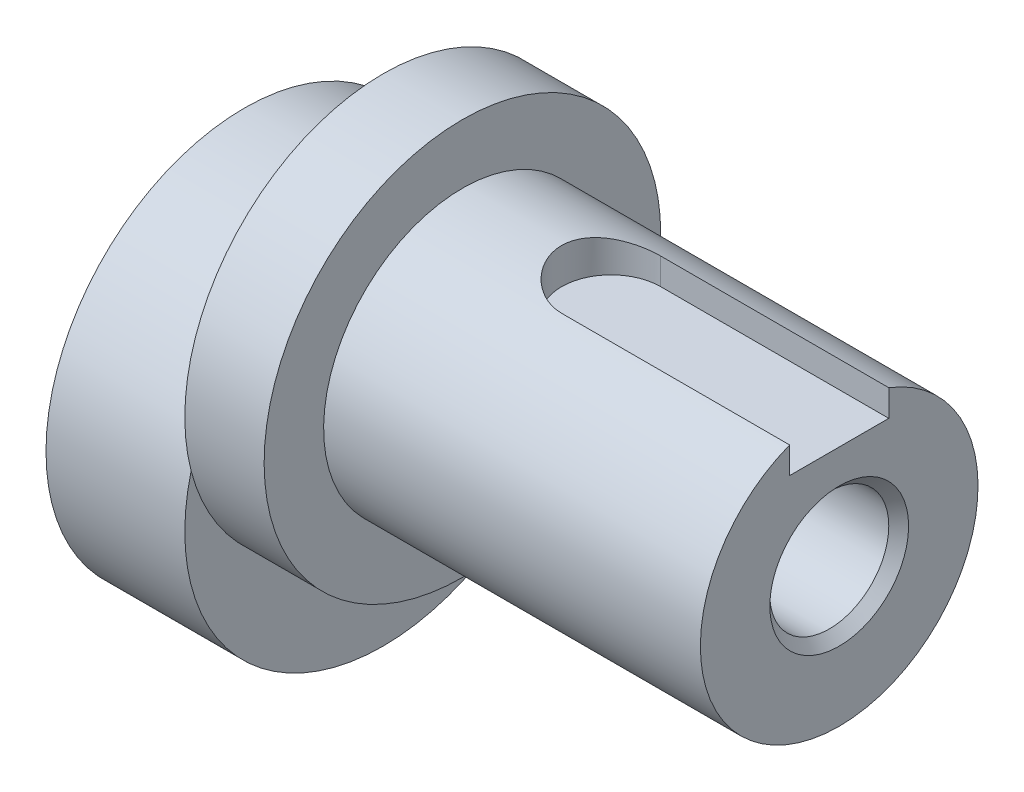
ISO-10303-21;
HEADER;
FILE_DESCRIPTION(('STEP AP214'),'2;1');
FILE_NAME('part.step','',(''),(''),'','','');
FILE_SCHEMA(('AUTOMOTIVE_DESIGN { 1 0 10303 214 1 1 1 1 }'));
ENDSEC;
DATA;
#1=APPLICATION_CONTEXT('core data for automotive mechanical design processes');
#2=APPLICATION_PROTOCOL_DEFINITION('international standard','automotive_design',2000,#1);
#3=PRODUCT_CONTEXT('',#1,'mechanical');
#4=PRODUCT('Part','Part','',(#3));
#5=PRODUCT_RELATED_PRODUCT_CATEGORY('part','',(#4));
#6=PRODUCT_DEFINITION_FORMATION('','',#4);
#7=PRODUCT_DEFINITION_CONTEXT('part definition',#1,'design');
#8=PRODUCT_DEFINITION('design','',#6,#7);
#9=PRODUCT_DEFINITION_SHAPE('','',#8);
#10=(LENGTH_UNIT() NAMED_UNIT(*) SI_UNIT(.MILLI.,.METRE.));
#11=(NAMED_UNIT(*) PLANE_ANGLE_UNIT() SI_UNIT($,.RADIAN.));
#12=(NAMED_UNIT(*) SI_UNIT($,.STERADIAN.) SOLID_ANGLE_UNIT());
#13=UNCERTAINTY_MEASURE_WITH_UNIT(LENGTH_MEASURE(1.E-05),#10,'distance_accuracy_value','');
#14=(GEOMETRIC_REPRESENTATION_CONTEXT(3) GLOBAL_UNCERTAINTY_ASSIGNED_CONTEXT((#13)) GLOBAL_UNIT_ASSIGNED_CONTEXT((#10,
#11,#12)) REPRESENTATION_CONTEXT('',''));
#15=CARTESIAN_POINT('',(0.,0.,0.));
#16=DIRECTION('',(0.,0.,1.));
#17=DIRECTION('',(1.,0.,0.));
#18=AXIS2_PLACEMENT_3D('',#15,#16,#17);
#19=CARTESIAN_POINT('',(30.,5.,0.));
#20=DIRECTION('',(-1.,0.,0.));
#21=DIRECTION('',(0.,0.,1.));
#22=AXIS2_PLACEMENT_3D('',#19,#20,#21);
#23=CYLINDRICAL_SURFACE('',#22,7.);
#24=CARTESIAN_POINT('',(11.,5.,0.));
#25=DIRECTION('',(1.,0.,0.));
#26=DIRECTION('',(0.,0.,-1.));
#27=AXIS2_PLACEMENT_3D('',#24,#25,#26);
#28=CIRCLE('',#27,7.);
#29=CARTESIAN_POINT('',(11.,5.,-7.));
#30=VERTEX_POINT('',#29);
#31=EDGE_CURVE('E118',#30,#30,#28,.T.);
#32=ORIENTED_EDGE('',*,*,#31,.T.);
#33=EDGE_LOOP('',(#32));
#34=FACE_BOUND('',#33,.T.);
#35=DIRECTION('',(-1.,0.,0.));
#36=VECTOR('',#35,1.);
#37=CARTESIAN_POINT('',(30.,11.538348415311,-2.5));
#38=LINE('',#37,#36);
#39=CARTESIAN_POINT('',(30.,11.538348415311,-2.5));
#40=VERTEX_POINT('',#39);
#41=CARTESIAN_POINT('',(18.5,11.538348415311,-2.5));
#42=VERTEX_POINT('',#41);
#43=EDGE_CURVE('E94',#40,#42,#38,.T.);
#44=ORIENTED_EDGE('',*,*,#43,.F.);
#45=CARTESIAN_POINT('',(30.,5.,0.));
#46=DIRECTION('',(1.,0.,0.));
#47=DIRECTION('',(0.,0.,-1.));
#48=AXIS2_PLACEMENT_3D('',#45,#46,#47);
#49=CIRCLE('',#48,7.);
#50=CARTESIAN_POINT('',(30.,11.538348415311,2.5));
#51=VERTEX_POINT('',#50);
#52=EDGE_CURVE('E114',#51,#40,#49,.T.);
#53=ORIENTED_EDGE('',*,*,#52,.F.);
#54=DIRECTION('',(-1.,0.,0.));
#55=VECTOR('',#54,1.);
#56=CARTESIAN_POINT('',(30.,11.538348415311,2.5));
#57=LINE('',#56,#55);
#58=CARTESIAN_POINT('',(18.5,11.538348415311,2.5));
#59=VERTEX_POINT('',#58);
#60=EDGE_CURVE('E98',#59,#51,#57,.F.);
#61=ORIENTED_EDGE('',*,*,#60,.F.);
#62=CARTESIAN_POINT('',(18.5,11.538348415311,-2.5));
#63=CARTESIAN_POINT('',(18.4321107542711,11.5383365378513,-2.50000932220903));
#64=CARTESIAN_POINT('',(18.3642280673609,11.5394054992274,-2.49723485076694));
#65=CARTESIAN_POINT('',(18.2289960893886,11.5436165747813,-2.4861910211816));
#66=CARTESIAN_POINT('',(18.1616466413939,11.5467580541806,-2.47792334551208));
#67=CARTESIAN_POINT('',(18.0281785853972,11.5550121763794,-2.456001752859));
#68=CARTESIAN_POINT('',(17.9620566636602,11.5601183170568,-2.44236559963955));
#69=CARTESIAN_POINT('',(17.8312981648915,11.5721317785417,-2.40985115466648));
#70=CARTESIAN_POINT('',(17.7666616536876,11.5790391790075,-2.39097263107435));
#71=CARTESIAN_POINT('',(17.5757356335225,11.6021493436571,-2.32673964179204));
#72=CARTESIAN_POINT('',(17.4522095478644,11.6207547534084,-2.27375112606986));
#73=CARTESIAN_POINT('',(17.215769666872,11.6622539736071,-2.14910757865425));
#74=CARTESIAN_POINT('',(17.1028636832645,11.6851509042488,-2.07743895048849));
#75=CARTESIAN_POINT('',(16.8857847866473,11.7337991379222,-1.9140257110197));
#76=CARTESIAN_POINT('',(16.7821535248041,11.7596286404137,-1.82158337146744));
#77=CARTESIAN_POINT('',(16.5914912952836,11.8105759232303,-1.6207338877633));
#78=CARTESIAN_POINT('',(16.5044634207566,11.8356935701987,-1.51232377552673));
#79=CARTESIAN_POINT('',(16.346910144545,11.8833113327905,-1.27853915335934));
#80=CARTESIAN_POINT('',(16.2769684781395,11.905708352238,-1.15274833789185));
#81=CARTESIAN_POINT('',(16.1594633532026,11.9444235767263,-0.890250825476634));
#82=CARTESIAN_POINT('',(16.111892220954,11.9607438658547,-0.753547890540326));
#83=CARTESIAN_POINT('',(16.0423593978176,11.9849105051071,-0.478829979256174));
#84=CARTESIAN_POINT('',(16.0194608695289,11.9930659435251,-0.341079835227466));
#85=CARTESIAN_POINT('',(15.9969315972223,12.0010879805382,-0.0634643052969036));
#86=CARTESIAN_POINT('',(15.9972944139653,12.000956873027,0.0764004845074482));
#87=CARTESIAN_POINT('',(16.0207112737611,11.9926225804908,0.347593258486945));
#88=CARTESIAN_POINT('',(16.0427447941985,11.9847824358352,0.47902240707872));
#89=CARTESIAN_POINT('',(16.1071734241588,11.9623783250735,0.736175812143607));
#90=CARTESIAN_POINT('',(16.1495696843625,11.9478139789904,0.861899745780464));
#91=CARTESIAN_POINT('',(16.2540469115653,11.9131650689037,1.10616102429807));
#92=CARTESIAN_POINT('',(16.3163957149601,11.8930059216431,1.22457279066906));
#93=CARTESIAN_POINT('',(16.4587793352234,11.8492335561632,1.44953531305523));
#94=CARTESIAN_POINT('',(16.5388195237836,11.8256192895926,1.5560824517677));
#95=CARTESIAN_POINT('',(16.7193232636567,11.7759054780549,1.7603244525607));
#96=CARTESIAN_POINT('',(16.8206497231449,11.7497405584388,1.85724185700417));
#97=CARTESIAN_POINT('',(17.0383273641656,11.6989034246898,2.03299914621296));
#98=CARTESIAN_POINT('',(17.1546839051685,11.6742317476526,2.11183255456462));
#99=CARTESIAN_POINT('',(17.401942598522,11.628778038754,2.25049860898459));
#100=CARTESIAN_POINT('',(17.5330789755054,11.6080787511899,2.30994207989625));
#101=CARTESIAN_POINT('',(17.8043648015822,11.5738821361027,2.4055543972585));
#102=CARTESIAN_POINT('',(17.944499141169,11.5603730716505,2.44176119399954));
#103=CARTESIAN_POINT('',(18.1550305442642,11.5470854224556,2.47705497148627));
#104=CARTESIAN_POINT('',(18.2237363017718,11.5438201096791,2.48565347586445));
#105=CARTESIAN_POINT('',(18.3616151641917,11.5394491082968,2.49712352174882));
#106=CARTESIAN_POINT('',(18.4307876671005,11.5383410314093,2.50000139665367));
#107=CARTESIAN_POINT('',(18.5,11.538348415311,2.5));
#108=B_SPLINE_CURVE_WITH_KNOTS('',3,(#62,#63,#64,#65,#66,#67,#68,#69,#70,#71,#72,#73,#74,#75,
#76,#77,#78,#79,#80,#81,#82,#83,#84,#85,#86,#87,#88,#89,#90,#91,#92,#93,#94,#95,#96,#97,#98,#99,
#100,#101,#102,#103,#104,#105,#106,#107),.UNSPECIFIED.,.F.,.F.,(4,2,2,2,2,2,2,2,2,2,2,2,2,2,2,2,
2,2,2,2,2,2,4),(0.,0.203591628551589,0.407120929225528,0.609982356545741,0.812852756635989,
1.21793118555512,1.6233052814847,2.0451597231193,2.4670926781184,2.90188398965561,
3.33652604665238,3.75400993940861,4.17137826416922,4.56998920861347,4.96862268086888,
5.37284909448639,5.77719841367921,6.20315837945087,6.6292706567472,7.06347329058504,
7.49696496492444,7.70468580162772,7.91217653896403),.UNSPECIFIED.);
#109=EDGE_CURVE('E11',#42,#59,#108,.T.);
#110=ORIENTED_EDGE('',*,*,#109,.F.);
#111=EDGE_LOOP('',(#44,#53,#61,#110));
#112=FACE_BOUND('',#111,.T.);
#113=ADVANCED_FACE('F34',(#34,#112),#23,.T.);
#114=CARTESIAN_POINT('',(30.,5.,0.));
#115=DIRECTION('',(1.,0.,0.));
#116=DIRECTION('',(0.,0.,-1.));
#117=AXIS2_PLACEMENT_3D('',#114,#115,#116);
#118=PLANE('',#117);
#119=CARTESIAN_POINT('',(30.,5.,0.));
#120=DIRECTION('',(1.,0.,0.));
#121=DIRECTION('',(0.,0.,-1.));
#122=AXIS2_PLACEMENT_3D('',#119,#120,#121);
#123=CIRCLE('',#122,3.50000000000002);
#124=CARTESIAN_POINT('',(30.,5.,-3.50000000000002));
#125=VERTEX_POINT('',#124);
#126=EDGE_CURVE('E138',#125,#125,#123,.F.);
#127=ORIENTED_EDGE('',*,*,#126,.T.);
#128=EDGE_LOOP('',(#127));
#129=FACE_BOUND('',#128,.T.);
#130=ORIENTED_EDGE('',*,*,#52,.T.);
#131=DIRECTION('',(0.,-1.,0.));
#132=VECTOR('',#131,1.);
#133=CARTESIAN_POINT('',(30.,5.,-2.5));
#134=LINE('',#133,#132);
#135=CARTESIAN_POINT('',(30.,10.2,-2.5));
#136=VERTEX_POINT('',#135);
#137=EDGE_CURVE('E48',#40,#136,#134,.T.);
#138=ORIENTED_EDGE('',*,*,#137,.T.);
#139=DIRECTION('',(0.,0.,1.));
#140=VECTOR('',#139,1.);
#141=CARTESIAN_POINT('',(30.,10.2,0.));
#142=LINE('',#141,#140);
#143=CARTESIAN_POINT('',(30.,10.2,2.5));
#144=VERTEX_POINT('',#143);
#145=EDGE_CURVE('E104',#136,#144,#142,.T.);
#146=ORIENTED_EDGE('',*,*,#145,.T.);
#147=DIRECTION('',(0.,1.,0.));
#148=VECTOR('',#147,1.);
#149=CARTESIAN_POINT('',(30.,5.,2.5));
#150=LINE('',#149,#148);
#151=EDGE_CURVE('E145',#144,#51,#150,.T.);
#152=ORIENTED_EDGE('',*,*,#151,.T.);
#153=EDGE_LOOP('',(#130,#138,#146,#152));
#154=FACE_BOUND('',#153,.T.);
#155=ADVANCED_FACE('F148',(#129,#154),#118,.T.);
#156=CARTESIAN_POINT('',(7.,0.,0.));
#157=DIRECTION('',(-1.,0.,0.));
#158=DIRECTION('',(0.,0.,1.));
#159=AXIS2_PLACEMENT_3D('',#156,#157,#158);
#160=CYLINDRICAL_SURFACE('',#159,10.);
#161=CARTESIAN_POINT('',(7.,0.,0.));
#162=DIRECTION('',(1.,0.,0.));
#163=DIRECTION('',(0.,0.,-1.));
#164=AXIS2_PLACEMENT_3D('',#161,#162,#163);
#165=CIRCLE('',#164,10.);
#166=CARTESIAN_POINT('',(7.,2.49999999999999,-9.68245836551854));
#167=VERTEX_POINT('',#166);
#168=CARTESIAN_POINT('',(7.,2.49999999999999,9.68245836551854));
#169=VERTEX_POINT('',#168);
#170=EDGE_CURVE('E122',#167,#169,#165,.T.);
#171=ORIENTED_EDGE('',*,*,#170,.F.);
#172=EDGE_CURVE('E130',#169,#167,#165,.T.);
#173=ORIENTED_EDGE('',*,*,#172,.F.);
#174=EDGE_LOOP('',(#171,#173));
#175=FACE_BOUND('',#174,.T.);
#176=CARTESIAN_POINT('',(0.,0.,0.));
#177=DIRECTION('',(1.,0.,0.));
#178=DIRECTION('',(0.,0.,-1.));
#179=AXIS2_PLACEMENT_3D('',#176,#177,#178);
#180=CIRCLE('',#179,10.);
#181=CARTESIAN_POINT('',(0.,0.,-10.));
#182=VERTEX_POINT('',#181);
#183=EDGE_CURVE('E126',#182,#182,#180,.T.);
#184=ORIENTED_EDGE('',*,*,#183,.T.);
#185=EDGE_LOOP('',(#184));
#186=FACE_BOUND('',#185,.T.);
#187=ADVANCED_FACE('F167',(#175,#186),#160,.T.);
#188=CARTESIAN_POINT('',(7.,0.,0.));
#189=DIRECTION('',(1.,0.,0.));
#190=DIRECTION('',(0.,0.,-1.));
#191=AXIS2_PLACEMENT_3D('',#188,#189,#190);
#192=PLANE('',#191);
#193=CARTESIAN_POINT('',(7.,5.,0.));
#194=DIRECTION('',(1.,0.,0.));
#195=DIRECTION('',(0.,0.,-1.));
#196=AXIS2_PLACEMENT_3D('',#193,#194,#195);
#197=CIRCLE('',#196,10.);
#198=EDGE_CURVE('E62',#169,#167,#197,.T.);
#199=ORIENTED_EDGE('',*,*,#198,.F.);
#200=ORIENTED_EDGE('',*,*,#172,.T.);
#201=EDGE_LOOP('',(#199,#200));
#202=FACE_BOUND('',#201,.T.);
#203=ADVANCED_FACE('F187',(#202),#192,.T.);
#204=CARTESIAN_POINT('',(0.,0.,0.));
#205=DIRECTION('',(1.,0.,0.));
#206=DIRECTION('',(0.,0.,-1.));
#207=AXIS2_PLACEMENT_3D('',#204,#205,#206);
#208=PLANE('',#207);
#209=CARTESIAN_POINT('',(0.,5.,0.));
#210=DIRECTION('',(1.,0.,0.));
#211=DIRECTION('',(0.,0.,-1.));
#212=AXIS2_PLACEMENT_3D('',#209,#210,#211);
#213=CIRCLE('',#212,3.5);
#214=CARTESIAN_POINT('',(0.,5.,-3.5));
#215=VERTEX_POINT('',#214);
#216=EDGE_CURVE('E141',#215,#215,#213,.T.);
#217=ORIENTED_EDGE('',*,*,#216,.T.);
#218=EDGE_LOOP('',(#217));
#219=FACE_BOUND('',#218,.T.);
#220=ORIENTED_EDGE('',*,*,#183,.F.);
#221=EDGE_LOOP('',(#220));
#222=FACE_BOUND('',#221,.T.);
#223=ADVANCED_FACE('F182',(#219,#222),#208,.F.);
#224=CARTESIAN_POINT('',(7.,5.,0.));
#225=DIRECTION('',(1.,0.,0.));
#226=DIRECTION('',(0.,0.,-1.));
#227=AXIS2_PLACEMENT_3D('',#224,#225,#226);
#228=PLANE('',#227);
#229=EDGE_CURVE('E117',#167,#169,#197,.T.);
#230=ORIENTED_EDGE('',*,*,#229,.F.);
#231=ORIENTED_EDGE('',*,*,#170,.T.);
#232=EDGE_LOOP('',(#230,#231));
#233=FACE_BOUND('',#232,.T.);
#234=ADVANCED_FACE('F179',(#233),#228,.F.);
#235=CARTESIAN_POINT('',(11.,5.,0.));
#236=DIRECTION('',(-1.,0.,0.));
#237=DIRECTION('',(0.,0.,1.));
#238=AXIS2_PLACEMENT_3D('',#235,#236,#237);
#239=CYLINDRICAL_SURFACE('',#238,10.);
#240=CARTESIAN_POINT('',(11.,5.,0.));
#241=DIRECTION('',(1.,0.,0.));
#242=DIRECTION('',(0.,0.,-1.));
#243=AXIS2_PLACEMENT_3D('',#240,#241,#242);
#244=CIRCLE('',#243,10.);
#245=CARTESIAN_POINT('',(11.,5.,-10.));
#246=VERTEX_POINT('',#245);
#247=EDGE_CURVE('E123',#246,#246,#244,.T.);
#248=ORIENTED_EDGE('',*,*,#247,.F.);
#249=EDGE_LOOP('',(#248));
#250=FACE_BOUND('',#249,.T.);
#251=ORIENTED_EDGE('',*,*,#198,.T.);
#252=ORIENTED_EDGE('',*,*,#229,.T.);
#253=EDGE_LOOP('',(#251,#252));
#254=FACE_BOUND('',#253,.T.);
#255=ADVANCED_FACE('F177',(#250,#254),#239,.T.);
#256=CARTESIAN_POINT('',(11.,5.,0.));
#257=DIRECTION('',(1.,0.,0.));
#258=DIRECTION('',(0.,0.,-1.));
#259=AXIS2_PLACEMENT_3D('',#256,#257,#258);
#260=PLANE('',#259);
#261=ORIENTED_EDGE('',*,*,#31,.F.);
#262=EDGE_LOOP('',(#261));
#263=FACE_BOUND('',#262,.T.);
#264=ORIENTED_EDGE('',*,*,#247,.T.);
#265=EDGE_LOOP('',(#264));
#266=FACE_BOUND('',#265,.T.);
#267=ADVANCED_FACE('F173',(#263,#266),#260,.T.);
#268=CARTESIAN_POINT('',(0.,5.,0.));
#269=DIRECTION('',(1.,0.,0.));
#270=DIRECTION('',(0.,0.,-1.));
#271=AXIS2_PLACEMENT_3D('',#268,#269,#270);
#272=CYLINDRICAL_SURFACE('',#271,3.);
#273=CARTESIAN_POINT('',(29.5,5.,0.));
#274=DIRECTION('',(1.,0.,0.));
#275=DIRECTION('',(0.,0.,-1.));
#276=AXIS2_PLACEMENT_3D('',#273,#274,#275);
#277=CIRCLE('',#276,3.);
#278=CARTESIAN_POINT('',(29.5,5.,-3.));
#279=VERTEX_POINT('',#278);
#280=EDGE_CURVE('E135',#279,#279,#277,.T.);
#281=ORIENTED_EDGE('',*,*,#280,.T.);
#282=EDGE_LOOP('',(#281));
#283=FACE_BOUND('',#282,.T.);
#284=CARTESIAN_POINT('',(0.500000000000003,5.,0.));
#285=DIRECTION('',(1.,0.,0.));
#286=DIRECTION('',(0.,0.,-1.));
#287=AXIS2_PLACEMENT_3D('',#284,#285,#286);
#288=CIRCLE('',#287,3.);
#289=CARTESIAN_POINT('',(0.500000000000003,5.,-3.));
#290=VERTEX_POINT('',#289);
#291=EDGE_CURVE('E121',#290,#290,#288,.F.);
#292=ORIENTED_EDGE('',*,*,#291,.T.);
#293=EDGE_LOOP('',(#292));
#294=FACE_BOUND('',#293,.T.);
#295=ADVANCED_FACE('F176',(#283,#294),#272,.F.);
#296=CARTESIAN_POINT('',(29.5,5.,0.));
#297=DIRECTION('',(1.,0.,0.));
#298=DIRECTION('',(0.,0.,-1.));
#299=AXIS2_PLACEMENT_3D('',#296,#297,#298);
#300=CONICAL_SURFACE('',#299,3.,0.785398163397451);
#301=ORIENTED_EDGE('',*,*,#126,.F.);
#302=EDGE_LOOP('',(#301));
#303=FACE_BOUND('',#302,.T.);
#304=ORIENTED_EDGE('',*,*,#280,.F.);
#305=EDGE_LOOP('',(#304));
#306=FACE_BOUND('',#305,.T.);
#307=ADVANCED_FACE('F195',(#303,#306),#300,.F.);
#308=CARTESIAN_POINT('',(0.,5.,0.));
#309=DIRECTION('',(-1.,0.,0.));
#310=DIRECTION('',(0.,0.,1.));
#311=AXIS2_PLACEMENT_3D('',#308,#309,#310);
#312=CONICAL_SURFACE('',#311,3.5,0.785398163397445);
#313=ORIENTED_EDGE('',*,*,#291,.F.);
#314=EDGE_LOOP('',(#313));
#315=FACE_BOUND('',#314,.T.);
#316=ORIENTED_EDGE('',*,*,#216,.F.);
#317=EDGE_LOOP('',(#316));
#318=FACE_BOUND('',#317,.T.);
#319=ADVANCED_FACE('F36',(#315,#318),#312,.F.);
#320=CARTESIAN_POINT('',(18.5,15.,0.));
#321=DIRECTION('',(0.,-1.,0.));
#322=DIRECTION('',(0.,0.,-1.));
#323=AXIS2_PLACEMENT_3D('',#320,#321,#322);
#324=CYLINDRICAL_SURFACE('',#323,2.5);
#325=ORIENTED_EDGE('',*,*,#109,.T.);
#326=DIRECTION('',(0.,-1.,0.));
#327=VECTOR('',#326,1.);
#328=CARTESIAN_POINT('',(18.5,15.,2.5));
#329=LINE('',#328,#327);
#330=CARTESIAN_POINT('',(18.5,10.2,2.5));
#331=VERTEX_POINT('',#330);
#332=EDGE_CURVE('E99',#59,#331,#329,.T.);
#333=ORIENTED_EDGE('',*,*,#332,.T.);
#334=CARTESIAN_POINT('',(18.5,10.2,0.));
#335=DIRECTION('',(0.,1.,0.));
#336=DIRECTION('',(0.,0.,1.));
#337=AXIS2_PLACEMENT_3D('',#334,#335,#336);
#338=CIRCLE('',#337,2.5);
#339=CARTESIAN_POINT('',(18.5,10.2,-2.5));
#340=VERTEX_POINT('',#339);
#341=EDGE_CURVE('E102',#340,#331,#338,.T.);
#342=ORIENTED_EDGE('',*,*,#341,.F.);
#343=DIRECTION('',(0.,-1.,0.));
#344=VECTOR('',#343,1.);
#345=CARTESIAN_POINT('',(18.5,15.,-2.5));
#346=LINE('',#345,#344);
#347=EDGE_CURVE('E88',#42,#340,#346,.T.);
#348=ORIENTED_EDGE('',*,*,#347,.F.);
#349=EDGE_LOOP('',(#325,#333,#342,#348));
#350=FACE_BOUND('',#349,.T.);
#351=ADVANCED_FACE('F106',(#350),#324,.F.);
#352=CARTESIAN_POINT('',(31.,15.,-2.5));
#353=DIRECTION('',(0.,0.,1.));
#354=DIRECTION('',(1.,0.,0.));
#355=AXIS2_PLACEMENT_3D('',#352,#353,#354);
#356=PLANE('',#355);
#357=ORIENTED_EDGE('',*,*,#43,.T.);
#358=ORIENTED_EDGE('',*,*,#347,.T.);
#359=DIRECTION('',(-1.,0.,0.));
#360=VECTOR('',#359,1.);
#361=CARTESIAN_POINT('',(31.,10.2,-2.5));
#362=LINE('',#361,#360);
#363=EDGE_CURVE('E91',#136,#340,#362,.T.);
#364=ORIENTED_EDGE('',*,*,#363,.F.);
#365=ORIENTED_EDGE('',*,*,#137,.F.);
#366=EDGE_LOOP('',(#357,#358,#364,#365));
#367=FACE_BOUND('',#366,.T.);
#368=ADVANCED_FACE('F90',(#367),#356,.T.);
#369=CARTESIAN_POINT('',(31.,15.,2.5));
#370=DIRECTION('',(0.,0.,-1.));
#371=DIRECTION('',(-1.,0.,0.));
#372=AXIS2_PLACEMENT_3D('',#369,#370,#371);
#373=PLANE('',#372);
#374=ORIENTED_EDGE('',*,*,#60,.T.);
#375=ORIENTED_EDGE('',*,*,#151,.F.);
#376=DIRECTION('',(1.,0.,0.));
#377=VECTOR('',#376,1.);
#378=CARTESIAN_POINT('',(31.,10.2,2.5));
#379=LINE('',#378,#377);
#380=EDGE_CURVE('E55',#331,#144,#379,.T.);
#381=ORIENTED_EDGE('',*,*,#380,.F.);
#382=ORIENTED_EDGE('',*,*,#332,.F.);
#383=EDGE_LOOP('',(#374,#375,#381,#382));
#384=FACE_BOUND('',#383,.T.);
#385=ADVANCED_FACE('F153',(#384),#373,.T.);
#386=CARTESIAN_POINT('',(18.5,10.2,0.));
#387=DIRECTION('',(0.,1.,0.));
#388=DIRECTION('',(0.,0.,1.));
#389=AXIS2_PLACEMENT_3D('',#386,#387,#388);
#390=PLANE('',#389);
#391=ORIENTED_EDGE('',*,*,#363,.T.);
#392=ORIENTED_EDGE('',*,*,#341,.T.);
#393=ORIENTED_EDGE('',*,*,#380,.T.);
#394=ORIENTED_EDGE('',*,*,#145,.F.);
#395=EDGE_LOOP('',(#391,#392,#393,#394));
#396=FACE_BOUND('',#395,.T.);
#397=ADVANCED_FACE('F101',(#396),#390,.T.);
#398=CLOSED_SHELL('',(#113,#155,#187,#203,#223,#234,#255,#267,#295,#307,#319,#351,#368,#385,#397));
#399=MANIFOLD_SOLID_BREP('B2',#398);
#400=ADVANCED_BREP_SHAPE_REPRESENTATION('',(#18,#399),#14);
#401=SHAPE_DEFINITION_REPRESENTATION(#9,#400);
ENDSEC;
END-ISO-10303-21;
